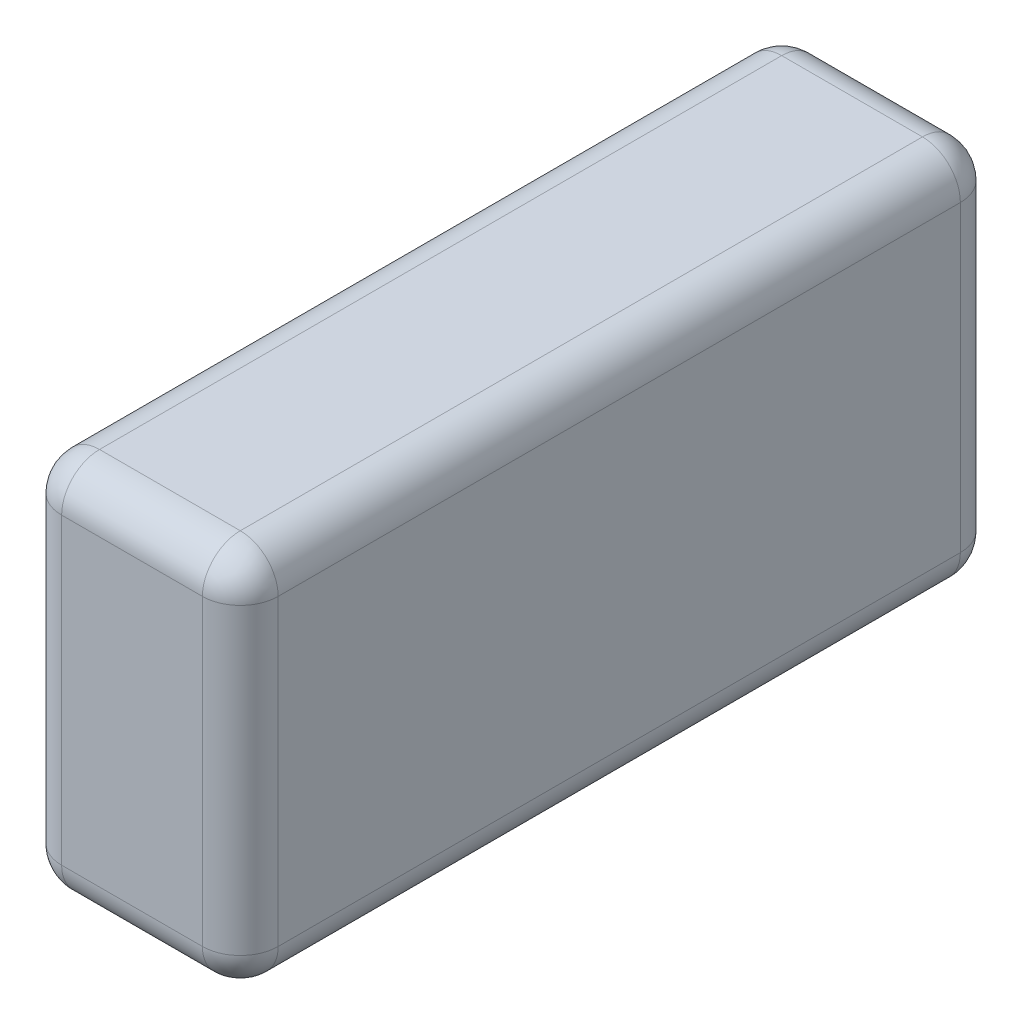
ISO-10303-21;
HEADER;
FILE_DESCRIPTION(('STEP AP214'),'2;1');
FILE_NAME('part.step','',(''),(''),'','','');
FILE_SCHEMA(('AUTOMOTIVE_DESIGN { 1 0 10303 214 1 1 1 1 }'));
ENDSEC;
DATA;
#1=APPLICATION_CONTEXT('core data for automotive mechanical design processes');
#2=APPLICATION_PROTOCOL_DEFINITION('international standard','automotive_design',2000,#1);
#3=PRODUCT_CONTEXT('',#1,'mechanical');
#4=PRODUCT('Part','Part','',(#3));
#5=PRODUCT_RELATED_PRODUCT_CATEGORY('part','',(#4));
#6=PRODUCT_DEFINITION_FORMATION('','',#4);
#7=PRODUCT_DEFINITION_CONTEXT('part definition',#1,'design');
#8=PRODUCT_DEFINITION('design','',#6,#7);
#9=PRODUCT_DEFINITION_SHAPE('','',#8);
#10=(LENGTH_UNIT() NAMED_UNIT(*) SI_UNIT(.MILLI.,.METRE.));
#11=(NAMED_UNIT(*) PLANE_ANGLE_UNIT() SI_UNIT($,.RADIAN.));
#12=(NAMED_UNIT(*) SI_UNIT($,.STERADIAN.) SOLID_ANGLE_UNIT());
#13=UNCERTAINTY_MEASURE_WITH_UNIT(LENGTH_MEASURE(1.E-05),#10,'distance_accuracy_value','');
#14=(GEOMETRIC_REPRESENTATION_CONTEXT(3) GLOBAL_UNCERTAINTY_ASSIGNED_CONTEXT((#13)) GLOBAL_UNIT_ASSIGNED_CONTEXT((#10,
#11,#12)) REPRESENTATION_CONTEXT('',''));
#15=CARTESIAN_POINT('',(0.,0.,0.));
#16=DIRECTION('',(0.,0.,1.));
#17=DIRECTION('',(1.,0.,0.));
#18=AXIS2_PLACEMENT_3D('',#15,#16,#17);
#19=CARTESIAN_POINT('',(200.,205.497925311203,-350.));
#20=DIRECTION('',(0.,0.,1.));
#21=DIRECTION('',(1.,0.,0.));
#22=AXIS2_PLACEMENT_3D('',#19,#20,#21);
#23=PLANE('',#22);
#24=DIRECTION('',(-1.,0.,0.));
#25=VECTOR('',#24,1.);
#26=CARTESIAN_POINT('',(200.,170.497925311203,-350.));
#27=LINE('',#26,#25);
#28=CARTESIAN_POINT('',(35.,170.497925311203,-350.));
#29=VERTEX_POINT('',#28);
#30=CARTESIAN_POINT('',(165.,170.497925311203,-350.));
#31=VERTEX_POINT('',#30);
#32=EDGE_CURVE('E142',#29,#31,#27,.F.);
#33=ORIENTED_EDGE('',*,*,#32,.T.);
#34=DIRECTION('',(0.,1.,0.));
#35=VECTOR('',#34,1.);
#36=CARTESIAN_POINT('',(165.,-144.502074688797,-350.));
#37=LINE('',#36,#35);
#38=CARTESIAN_POINT('',(165.,-109.502074688797,-350.));
#39=VERTEX_POINT('',#38);
#40=EDGE_CURVE('E188',#31,#39,#37,.F.);
#41=ORIENTED_EDGE('',*,*,#40,.T.);
#42=DIRECTION('',(-1.,0.,0.));
#43=VECTOR('',#42,1.);
#44=CARTESIAN_POINT('',(200.,-109.502074688797,-350.));
#45=LINE('',#44,#43);
#46=CARTESIAN_POINT('',(35.,-109.502074688797,-350.));
#47=VERTEX_POINT('',#46);
#48=EDGE_CURVE('E183',#39,#47,#45,.T.);
#49=ORIENTED_EDGE('',*,*,#48,.T.);
#50=DIRECTION('',(0.,1.,0.));
#51=VECTOR('',#50,1.);
#52=CARTESIAN_POINT('',(35.,205.497925311203,-350.));
#53=LINE('',#52,#51);
#54=EDGE_CURVE('E177',#47,#29,#53,.T.);
#55=ORIENTED_EDGE('',*,*,#54,.T.);
#56=EDGE_LOOP('',(#33,#41,#49,#55));
#57=FACE_BOUND('',#56,.T.);
#58=ADVANCED_FACE('F45',(#57),#23,.F.);
#59=CARTESIAN_POINT('',(200.,205.497925311203,350.));
#60=DIRECTION('',(0.,-1.,0.));
#61=DIRECTION('',(0.,0.,-1.));
#62=AXIS2_PLACEMENT_3D('',#59,#60,#61);
#63=PLANE('',#62);
#64=DIRECTION('',(-1.,0.,0.));
#65=VECTOR('',#64,1.);
#66=CARTESIAN_POINT('',(200.,205.497925311203,315.));
#67=LINE('',#66,#65);
#68=CARTESIAN_POINT('',(35.,205.497925311203,315.));
#69=VERTEX_POINT('',#68);
#70=CARTESIAN_POINT('',(165.,205.497925311203,315.));
#71=VERTEX_POINT('',#70);
#72=EDGE_CURVE('E167',#69,#71,#67,.F.);
#73=ORIENTED_EDGE('',*,*,#72,.T.);
#74=DIRECTION('',(0.,0.,1.));
#75=VECTOR('',#74,1.);
#76=CARTESIAN_POINT('',(165.,205.497925311203,-350.));
#77=LINE('',#76,#75);
#78=CARTESIAN_POINT('',(165.,205.497925311203,-315.));
#79=VERTEX_POINT('',#78);
#80=EDGE_CURVE('E171',#71,#79,#77,.F.);
#81=ORIENTED_EDGE('',*,*,#80,.T.);
#82=DIRECTION('',(-1.,0.,0.));
#83=VECTOR('',#82,1.);
#84=CARTESIAN_POINT('',(200.,205.497925311203,-315.));
#85=LINE('',#84,#83);
#86=CARTESIAN_POINT('',(35.,205.497925311203,-315.));
#87=VERTEX_POINT('',#86);
#88=EDGE_CURVE('E140',#79,#87,#85,.T.);
#89=ORIENTED_EDGE('',*,*,#88,.T.);
#90=DIRECTION('',(0.,0.,1.));
#91=VECTOR('',#90,1.);
#92=CARTESIAN_POINT('',(35.,205.497925311203,350.));
#93=LINE('',#92,#91);
#94=EDGE_CURVE('E160',#87,#69,#93,.T.);
#95=ORIENTED_EDGE('',*,*,#94,.T.);
#96=EDGE_LOOP('',(#73,#81,#89,#95));
#97=FACE_BOUND('',#96,.T.);
#98=ADVANCED_FACE('F169',(#97),#63,.F.);
#99=CARTESIAN_POINT('',(200.,205.497925311203,350.));
#100=DIRECTION('',(0.,0.,-1.));
#101=DIRECTION('',(-1.,0.,0.));
#102=AXIS2_PLACEMENT_3D('',#99,#100,#101);
#103=PLANE('',#102);
#104=DIRECTION('',(-1.,0.,0.));
#105=VECTOR('',#104,1.);
#106=CARTESIAN_POINT('',(200.,-109.502074688797,350.));
#107=LINE('',#106,#105);
#108=CARTESIAN_POINT('',(35.,-109.502074688797,350.));
#109=VERTEX_POINT('',#108);
#110=CARTESIAN_POINT('',(165.,-109.502074688797,350.));
#111=VERTEX_POINT('',#110);
#112=EDGE_CURVE('E194',#109,#111,#107,.F.);
#113=ORIENTED_EDGE('',*,*,#112,.T.);
#114=DIRECTION('',(0.,-1.,0.));
#115=VECTOR('',#114,1.);
#116=CARTESIAN_POINT('',(165.,205.497925311203,350.));
#117=LINE('',#116,#115);
#118=CARTESIAN_POINT('',(165.,170.497925311203,350.));
#119=VERTEX_POINT('',#118);
#120=EDGE_CURVE('E201',#111,#119,#117,.F.);
#121=ORIENTED_EDGE('',*,*,#120,.T.);
#122=DIRECTION('',(-1.,0.,0.));
#123=VECTOR('',#122,1.);
#124=CARTESIAN_POINT('',(200.,170.497925311203,350.));
#125=LINE('',#124,#123);
#126=CARTESIAN_POINT('',(35.,170.497925311203,350.));
#127=VERTEX_POINT('',#126);
#128=EDGE_CURVE('E197',#119,#127,#125,.T.);
#129=ORIENTED_EDGE('',*,*,#128,.T.);
#130=DIRECTION('',(0.,-1.,0.));
#131=VECTOR('',#130,1.);
#132=CARTESIAN_POINT('',(35.,205.497925311203,350.));
#133=LINE('',#132,#131);
#134=EDGE_CURVE('E191',#127,#109,#133,.T.);
#135=ORIENTED_EDGE('',*,*,#134,.T.);
#136=EDGE_LOOP('',(#113,#121,#129,#135));
#137=FACE_BOUND('',#136,.T.);
#138=ADVANCED_FACE('F340',(#137),#103,.F.);
#139=CARTESIAN_POINT('',(200.,-144.502074688797,350.));
#140=DIRECTION('',(0.,1.,0.));
#141=DIRECTION('',(0.,0.,1.));
#142=AXIS2_PLACEMENT_3D('',#139,#140,#141);
#143=PLANE('',#142);
#144=DIRECTION('',(-1.,0.,0.));
#145=VECTOR('',#144,1.);
#146=CARTESIAN_POINT('',(200.,-144.502074688797,-315.));
#147=LINE('',#146,#145);
#148=CARTESIAN_POINT('',(35.,-144.502074688797,-315.));
#149=VERTEX_POINT('',#148);
#150=CARTESIAN_POINT('',(165.,-144.502074688797,-315.));
#151=VERTEX_POINT('',#150);
#152=EDGE_CURVE('E207',#149,#151,#147,.F.);
#153=ORIENTED_EDGE('',*,*,#152,.T.);
#154=DIRECTION('',(0.,0.,-1.));
#155=VECTOR('',#154,1.);
#156=CARTESIAN_POINT('',(165.,-144.502074688797,350.));
#157=LINE('',#156,#155);
#158=CARTESIAN_POINT('',(165.,-144.502074688797,315.));
#159=VERTEX_POINT('',#158);
#160=EDGE_CURVE('E214',#151,#159,#157,.F.);
#161=ORIENTED_EDGE('',*,*,#160,.T.);
#162=DIRECTION('',(-1.,0.,0.));
#163=VECTOR('',#162,1.);
#164=CARTESIAN_POINT('',(200.,-144.502074688797,315.));
#165=LINE('',#164,#163);
#166=CARTESIAN_POINT('',(35.,-144.502074688797,315.));
#167=VERTEX_POINT('',#166);
#168=EDGE_CURVE('E210',#159,#167,#165,.T.);
#169=ORIENTED_EDGE('',*,*,#168,.T.);
#170=DIRECTION('',(0.,0.,-1.));
#171=VECTOR('',#170,1.);
#172=CARTESIAN_POINT('',(35.,-144.502074688797,350.));
#173=LINE('',#172,#171);
#174=EDGE_CURVE('E204',#167,#149,#173,.T.);
#175=ORIENTED_EDGE('',*,*,#174,.T.);
#176=EDGE_LOOP('',(#153,#161,#169,#175));
#177=FACE_BOUND('',#176,.T.);
#178=ADVANCED_FACE('F351',(#177),#143,.F.);
#179=CARTESIAN_POINT('',(200.,0.,0.));
#180=DIRECTION('',(1.,0.,0.));
#181=DIRECTION('',(0.,0.,-1.));
#182=AXIS2_PLACEMENT_3D('',#179,#180,#181);
#183=PLANE('',#182);
#184=DIRECTION('',(0.,-1.,0.));
#185=VECTOR('',#184,1.);
#186=CARTESIAN_POINT('',(200.,-144.502074688797,315.));
#187=LINE('',#186,#185);
#188=CARTESIAN_POINT('',(200.,170.497925311203,315.));
#189=VERTEX_POINT('',#188);
#190=CARTESIAN_POINT('',(200.,-109.502074688797,315.));
#191=VERTEX_POINT('',#190);
#192=EDGE_CURVE('E223',#189,#191,#187,.T.);
#193=ORIENTED_EDGE('',*,*,#192,.T.);
#194=DIRECTION('',(0.,0.,-1.));
#195=VECTOR('',#194,1.);
#196=CARTESIAN_POINT('',(200.,-109.502074688797,-350.));
#197=LINE('',#196,#195);
#198=CARTESIAN_POINT('',(200.,-109.502074688797,-315.));
#199=VERTEX_POINT('',#198);
#200=EDGE_CURVE('E226',#191,#199,#197,.T.);
#201=ORIENTED_EDGE('',*,*,#200,.T.);
#202=DIRECTION('',(0.,1.,0.));
#203=VECTOR('',#202,1.);
#204=CARTESIAN_POINT('',(200.,205.497925311203,-315.));
#205=LINE('',#204,#203);
#206=CARTESIAN_POINT('',(200.,170.497925311203,-315.));
#207=VERTEX_POINT('',#206);
#208=EDGE_CURVE('E217',#199,#207,#205,.T.);
#209=ORIENTED_EDGE('',*,*,#208,.T.);
#210=DIRECTION('',(0.,0.,1.));
#211=VECTOR('',#210,1.);
#212=CARTESIAN_POINT('',(200.,170.497925311203,350.));
#213=LINE('',#212,#211);
#214=EDGE_CURVE('E220',#207,#189,#213,.T.);
#215=ORIENTED_EDGE('',*,*,#214,.T.);
#216=EDGE_LOOP('',(#193,#201,#209,#215));
#217=FACE_BOUND('',#216,.T.);
#218=ADVANCED_FACE('F332',(#217),#183,.T.);
#219=CARTESIAN_POINT('',(0.,0.,0.));
#220=DIRECTION('',(1.,0.,0.));
#221=DIRECTION('',(0.,0.,-1.));
#222=AXIS2_PLACEMENT_3D('',#219,#220,#221);
#223=PLANE('',#222);
#224=DIRECTION('',(0.,-1.,0.));
#225=VECTOR('',#224,1.);
#226=CARTESIAN_POINT('',(0.,0.,315.));
#227=LINE('',#226,#225);
#228=CARTESIAN_POINT('',(0.,-109.502074688797,315.));
#229=VERTEX_POINT('',#228);
#230=CARTESIAN_POINT('',(0.,170.497925311203,315.));
#231=VERTEX_POINT('',#230);
#232=EDGE_CURVE('E55',#229,#231,#227,.F.);
#233=ORIENTED_EDGE('',*,*,#232,.T.);
#234=DIRECTION('',(0.,0.,1.));
#235=VECTOR('',#234,1.);
#236=CARTESIAN_POINT('',(0.,170.497925311203,0.));
#237=LINE('',#236,#235);
#238=CARTESIAN_POINT('',(0.,170.497925311203,-315.));
#239=VERTEX_POINT('',#238);
#240=EDGE_CURVE('E11',#231,#239,#237,.F.);
#241=ORIENTED_EDGE('',*,*,#240,.T.);
#242=DIRECTION('',(0.,1.,0.));
#243=VECTOR('',#242,1.);
#244=CARTESIAN_POINT('',(0.,0.,-315.));
#245=LINE('',#244,#243);
#246=CARTESIAN_POINT('',(0.,-109.502074688797,-315.));
#247=VERTEX_POINT('',#246);
#248=EDGE_CURVE('E230',#239,#247,#245,.F.);
#249=ORIENTED_EDGE('',*,*,#248,.T.);
#250=DIRECTION('',(0.,0.,-1.));
#251=VECTOR('',#250,1.);
#252=CARTESIAN_POINT('',(0.,-109.502074688797,0.));
#253=LINE('',#252,#251);
#254=EDGE_CURVE('E66',#247,#229,#253,.F.);
#255=ORIENTED_EDGE('',*,*,#254,.T.);
#256=EDGE_LOOP('',(#233,#241,#249,#255));
#257=FACE_BOUND('',#256,.T.);
#258=ADVANCED_FACE('F577',(#257),#223,.F.);
#259=CARTESIAN_POINT('',(200.,-109.502074688797,315.));
#260=DIRECTION('',(-1.,0.,0.));
#261=DIRECTION('',(0.,0.,1.));
#262=AXIS2_PLACEMENT_3D('',#259,#260,#261);
#263=CYLINDRICAL_SURFACE('',#262,35.);
#264=CARTESIAN_POINT('',(165.,-109.502074688797,315.));
#265=DIRECTION('',(1.,0.,0.));
#266=DIRECTION('',(0.,0.,-1.));
#267=AXIS2_PLACEMENT_3D('',#264,#265,#266);
#268=CIRCLE('',#267,35.);
#269=EDGE_CURVE('E49',#111,#159,#268,.T.);
#270=ORIENTED_EDGE('',*,*,#269,.F.);
#271=ORIENTED_EDGE('',*,*,#112,.F.);
#272=CARTESIAN_POINT('',(35.,-109.502074688797,315.));
#273=DIRECTION('',(-1.,0.,0.));
#274=DIRECTION('',(0.,0.,1.));
#275=AXIS2_PLACEMENT_3D('',#272,#273,#274);
#276=CIRCLE('',#275,35.);
#277=EDGE_CURVE('E307',#167,#109,#276,.T.);
#278=ORIENTED_EDGE('',*,*,#277,.F.);
#279=ORIENTED_EDGE('',*,*,#168,.F.);
#280=EDGE_LOOP('',(#270,#271,#278,#279));
#281=FACE_BOUND('',#280,.T.);
#282=ADVANCED_FACE('F47',(#281),#263,.T.);
#283=CARTESIAN_POINT('',(165.,-109.502074688797,315.));
#284=DIRECTION('',(0.,-1.,0.));
#285=DIRECTION('',(0.,0.,-1.));
#286=AXIS2_PLACEMENT_3D('',#283,#284,#285);
#287=SPHERICAL_SURFACE('',#286,35.);
#288=CARTESIAN_POINT('',(165.,-109.502074688797,315.));
#289=DIRECTION('',(0.,-1.,0.));
#290=DIRECTION('',(0.,0.,-1.));
#291=AXIS2_PLACEMENT_3D('',#288,#289,#290);
#292=CIRCLE('',#291,35.);
#293=EDGE_CURVE('E300',#111,#191,#292,.F.);
#294=ORIENTED_EDGE('',*,*,#293,.F.);
#295=ORIENTED_EDGE('',*,*,#269,.T.);
#296=CARTESIAN_POINT('',(165.,-109.502074688797,315.));
#297=DIRECTION('',(0.,0.,1.));
#298=DIRECTION('',(1.,0.,0.));
#299=AXIS2_PLACEMENT_3D('',#296,#297,#298);
#300=CIRCLE('',#299,35.);
#301=EDGE_CURVE('E304',#191,#159,#300,.F.);
#302=ORIENTED_EDGE('',*,*,#301,.F.);
#303=EDGE_LOOP('',(#294,#295,#302));
#304=FACE_BOUND('',#303,.T.);
#305=ADVANCED_FACE('F320',(#304),#287,.T.);
#306=CARTESIAN_POINT('',(35.,-109.502074688797,315.));
#307=DIRECTION('',(0.,0.,1.));
#308=DIRECTION('',(1.,0.,0.));
#309=AXIS2_PLACEMENT_3D('',#306,#307,#308);
#310=SPHERICAL_SURFACE('',#309,35.);
#311=CARTESIAN_POINT('',(35.,-109.502074688797,315.));
#312=DIRECTION('',(0.,0.,1.));
#313=DIRECTION('',(1.,0.,0.));
#314=AXIS2_PLACEMENT_3D('',#311,#312,#313);
#315=CIRCLE('',#314,35.);
#316=EDGE_CURVE('E293',#167,#229,#315,.F.);
#317=ORIENTED_EDGE('',*,*,#316,.F.);
#318=ORIENTED_EDGE('',*,*,#277,.T.);
#319=CARTESIAN_POINT('',(35.,-109.502074688797,315.));
#320=DIRECTION('',(0.,-1.,0.));
#321=DIRECTION('',(0.,0.,-1.));
#322=AXIS2_PLACEMENT_3D('',#319,#320,#321);
#323=CIRCLE('',#322,35.);
#324=EDGE_CURVE('E296',#229,#109,#323,.F.);
#325=ORIENTED_EDGE('',*,*,#324,.F.);
#326=EDGE_LOOP('',(#317,#318,#325));
#327=FACE_BOUND('',#326,.T.);
#328=ADVANCED_FACE('F550',(#327),#310,.T.);
#329=CARTESIAN_POINT('',(165.,-109.502074688797,0.));
#330=DIRECTION('',(0.,0.,1.));
#331=DIRECTION('',(1.,0.,0.));
#332=AXIS2_PLACEMENT_3D('',#329,#330,#331);
#333=CYLINDRICAL_SURFACE('',#332,35.);
#334=ORIENTED_EDGE('',*,*,#301,.T.);
#335=ORIENTED_EDGE('',*,*,#160,.F.);
#336=CARTESIAN_POINT('',(165.,-109.502074688797,-315.));
#337=DIRECTION('',(0.,0.,-1.));
#338=DIRECTION('',(-1.,0.,0.));
#339=AXIS2_PLACEMENT_3D('',#336,#337,#338);
#340=CIRCLE('',#339,35.);
#341=EDGE_CURVE('E285',#199,#151,#340,.T.);
#342=ORIENTED_EDGE('',*,*,#341,.F.);
#343=ORIENTED_EDGE('',*,*,#200,.F.);
#344=EDGE_LOOP('',(#334,#335,#342,#343));
#345=FACE_BOUND('',#344,.T.);
#346=ADVANCED_FACE('F328',(#345),#333,.T.);
#347=CARTESIAN_POINT('',(165.,0.,315.));
#348=DIRECTION('',(0.,1.,0.));
#349=DIRECTION('',(0.,0.,1.));
#350=AXIS2_PLACEMENT_3D('',#347,#348,#349);
#351=CYLINDRICAL_SURFACE('',#350,35.);
#352=ORIENTED_EDGE('',*,*,#293,.T.);
#353=ORIENTED_EDGE('',*,*,#192,.F.);
#354=CARTESIAN_POINT('',(165.,170.497925311203,315.));
#355=DIRECTION('',(0.,1.,0.));
#356=DIRECTION('',(0.,0.,1.));
#357=AXIS2_PLACEMENT_3D('',#354,#355,#356);
#358=CIRCLE('',#357,35.);
#359=EDGE_CURVE('E281',#119,#189,#358,.T.);
#360=ORIENTED_EDGE('',*,*,#359,.F.);
#361=ORIENTED_EDGE('',*,*,#120,.F.);
#362=EDGE_LOOP('',(#352,#353,#360,#361));
#363=FACE_BOUND('',#362,.T.);
#364=ADVANCED_FACE('F337',(#363),#351,.T.);
#365=CARTESIAN_POINT('',(200.,170.497925311203,315.));
#366=DIRECTION('',(-1.,0.,0.));
#367=DIRECTION('',(0.,0.,1.));
#368=AXIS2_PLACEMENT_3D('',#365,#366,#367);
#369=CYLINDRICAL_SURFACE('',#368,35.);
#370=CARTESIAN_POINT('',(35.,170.497925311203,315.));
#371=DIRECTION('',(-1.,0.,0.));
#372=DIRECTION('',(0.,0.,1.));
#373=AXIS2_PLACEMENT_3D('',#370,#371,#372);
#374=CIRCLE('',#373,35.);
#375=EDGE_CURVE('E273',#127,#69,#374,.T.);
#376=ORIENTED_EDGE('',*,*,#375,.F.);
#377=ORIENTED_EDGE('',*,*,#128,.F.);
#378=CARTESIAN_POINT('',(165.,170.497925311203,315.));
#379=DIRECTION('',(1.,0.,0.));
#380=DIRECTION('',(0.,0.,-1.));
#381=AXIS2_PLACEMENT_3D('',#378,#379,#380);
#382=CIRCLE('',#381,35.);
#383=EDGE_CURVE('E277',#71,#119,#382,.T.);
#384=ORIENTED_EDGE('',*,*,#383,.F.);
#385=ORIENTED_EDGE('',*,*,#72,.F.);
#386=EDGE_LOOP('',(#376,#377,#384,#385));
#387=FACE_BOUND('',#386,.T.);
#388=ADVANCED_FACE('F344',(#387),#369,.T.);
#389=CARTESIAN_POINT('',(35.,205.497925311203,315.));
#390=DIRECTION('',(0.,-1.,0.));
#391=DIRECTION('',(0.,0.,-1.));
#392=AXIS2_PLACEMENT_3D('',#389,#390,#391);
#393=CYLINDRICAL_SURFACE('',#392,35.);
#394=ORIENTED_EDGE('',*,*,#324,.T.);
#395=ORIENTED_EDGE('',*,*,#134,.F.);
#396=CARTESIAN_POINT('',(35.,170.497925311203,315.));
#397=DIRECTION('',(0.,1.,0.));
#398=DIRECTION('',(0.,0.,1.));
#399=AXIS2_PLACEMENT_3D('',#396,#397,#398);
#400=CIRCLE('',#399,35.);
#401=EDGE_CURVE('E270',#231,#127,#400,.T.);
#402=ORIENTED_EDGE('',*,*,#401,.F.);
#403=ORIENTED_EDGE('',*,*,#232,.F.);
#404=EDGE_LOOP('',(#394,#395,#402,#403));
#405=FACE_BOUND('',#404,.T.);
#406=ADVANCED_FACE('F349',(#405),#393,.T.);
#407=CARTESIAN_POINT('',(35.,-109.502074688797,350.));
#408=DIRECTION('',(0.,0.,-1.));
#409=DIRECTION('',(-1.,0.,0.));
#410=AXIS2_PLACEMENT_3D('',#407,#408,#409);
#411=CYLINDRICAL_SURFACE('',#410,35.);
#412=ORIENTED_EDGE('',*,*,#316,.T.);
#413=ORIENTED_EDGE('',*,*,#254,.F.);
#414=CARTESIAN_POINT('',(35.,-109.502074688797,-315.));
#415=DIRECTION('',(0.,0.,-1.));
#416=DIRECTION('',(-1.,0.,0.));
#417=AXIS2_PLACEMENT_3D('',#414,#415,#416);
#418=CIRCLE('',#417,35.);
#419=EDGE_CURVE('E266',#149,#247,#418,.T.);
#420=ORIENTED_EDGE('',*,*,#419,.F.);
#421=ORIENTED_EDGE('',*,*,#174,.F.);
#422=EDGE_LOOP('',(#412,#413,#420,#421));
#423=FACE_BOUND('',#422,.T.);
#424=ADVANCED_FACE('F360',(#423),#411,.T.);
#425=CARTESIAN_POINT('',(200.,-109.502074688797,-315.));
#426=DIRECTION('',(-1.,0.,0.));
#427=DIRECTION('',(0.,0.,1.));
#428=AXIS2_PLACEMENT_3D('',#425,#426,#427);
#429=CYLINDRICAL_SURFACE('',#428,35.);
#430=CARTESIAN_POINT('',(165.,-109.502074688797,-315.));
#431=DIRECTION('',(1.,0.,0.));
#432=DIRECTION('',(0.,0.,-1.));
#433=AXIS2_PLACEMENT_3D('',#430,#431,#432);
#434=CIRCLE('',#433,35.);
#435=EDGE_CURVE('E289',#151,#39,#434,.T.);
#436=ORIENTED_EDGE('',*,*,#435,.F.);
#437=ORIENTED_EDGE('',*,*,#152,.F.);
#438=CARTESIAN_POINT('',(35.,-109.502074688797,-315.));
#439=DIRECTION('',(-1.,0.,0.));
#440=DIRECTION('',(0.,0.,1.));
#441=AXIS2_PLACEMENT_3D('',#438,#439,#440);
#442=CIRCLE('',#441,35.);
#443=EDGE_CURVE('E262',#47,#149,#442,.T.);
#444=ORIENTED_EDGE('',*,*,#443,.F.);
#445=ORIENTED_EDGE('',*,*,#48,.F.);
#446=EDGE_LOOP('',(#436,#437,#444,#445));
#447=FACE_BOUND('',#446,.T.);
#448=ADVANCED_FACE('F356',(#447),#429,.T.);
#449=CARTESIAN_POINT('',(165.,-109.502074688797,-315.));
#450=DIRECTION('',(0.,-1.,0.));
#451=DIRECTION('',(0.,0.,-1.));
#452=AXIS2_PLACEMENT_3D('',#449,#450,#451);
#453=SPHERICAL_SURFACE('',#452,35.);
#454=ORIENTED_EDGE('',*,*,#341,.T.);
#455=ORIENTED_EDGE('',*,*,#435,.T.);
#456=CARTESIAN_POINT('',(165.,-109.502074688797,-315.));
#457=DIRECTION('',(0.,-1.,0.));
#458=DIRECTION('',(1.,0.,0.));
#459=AXIS2_PLACEMENT_3D('',#456,#457,#458);
#460=CIRCLE('',#459,35.);
#461=EDGE_CURVE('E258',#199,#39,#460,.F.);
#462=ORIENTED_EDGE('',*,*,#461,.F.);
#463=EDGE_LOOP('',(#454,#455,#462));
#464=FACE_BOUND('',#463,.T.);
#465=ADVANCED_FACE('F370',(#464),#453,.T.);
#466=CARTESIAN_POINT('',(165.,170.497925311203,315.));
#467=DIRECTION('',(0.,0.,1.));
#468=DIRECTION('',(1.,0.,0.));
#469=AXIS2_PLACEMENT_3D('',#466,#467,#468);
#470=SPHERICAL_SURFACE('',#469,35.);
#471=ORIENTED_EDGE('',*,*,#383,.T.);
#472=ORIENTED_EDGE('',*,*,#359,.T.);
#473=CARTESIAN_POINT('',(165.,170.497925311203,315.));
#474=DIRECTION('',(0.,0.,1.));
#475=DIRECTION('',(1.,0.,0.));
#476=AXIS2_PLACEMENT_3D('',#473,#474,#475);
#477=CIRCLE('',#476,35.);
#478=EDGE_CURVE('E254',#71,#189,#477,.F.);
#479=ORIENTED_EDGE('',*,*,#478,.F.);
#480=EDGE_LOOP('',(#471,#472,#479));
#481=FACE_BOUND('',#480,.T.);
#482=ADVANCED_FACE('F380',(#481),#470,.T.);
#483=CARTESIAN_POINT('',(35.,170.497925311203,315.));
#484=DIRECTION('',(0.,0.,1.));
#485=DIRECTION('',(1.,0.,0.));
#486=AXIS2_PLACEMENT_3D('',#483,#484,#485);
#487=SPHERICAL_SURFACE('',#486,35.);
#488=ORIENTED_EDGE('',*,*,#401,.T.);
#489=ORIENTED_EDGE('',*,*,#375,.T.);
#490=CARTESIAN_POINT('',(35.,170.497925311203,315.));
#491=DIRECTION('',(0.,0.,1.));
#492=DIRECTION('',(1.,0.,0.));
#493=AXIS2_PLACEMENT_3D('',#490,#491,#492);
#494=CIRCLE('',#493,35.);
#495=EDGE_CURVE('E163',#231,#69,#494,.F.);
#496=ORIENTED_EDGE('',*,*,#495,.F.);
#497=EDGE_LOOP('',(#488,#489,#496));
#498=FACE_BOUND('',#497,.T.);
#499=ADVANCED_FACE('F382',(#498),#487,.T.);
#500=CARTESIAN_POINT('',(35.,-109.502074688797,-315.));
#501=DIRECTION('',(0.,-1.,0.));
#502=DIRECTION('',(0.,0.,-1.));
#503=AXIS2_PLACEMENT_3D('',#500,#501,#502);
#504=SPHERICAL_SURFACE('',#503,35.);
#505=ORIENTED_EDGE('',*,*,#443,.T.);
#506=ORIENTED_EDGE('',*,*,#419,.T.);
#507=CARTESIAN_POINT('',(35.,-109.502074688797,-315.));
#508=DIRECTION('',(0.,-1.,0.));
#509=DIRECTION('',(0.,0.,-1.));
#510=AXIS2_PLACEMENT_3D('',#507,#508,#509);
#511=CIRCLE('',#510,35.);
#512=EDGE_CURVE('E248',#47,#247,#511,.F.);
#513=ORIENTED_EDGE('',*,*,#512,.F.);
#514=EDGE_LOOP('',(#505,#506,#513));
#515=FACE_BOUND('',#514,.T.);
#516=ADVANCED_FACE('F362',(#515),#504,.T.);
#517=CARTESIAN_POINT('',(165.,0.,-315.));
#518=DIRECTION('',(0.,-1.,0.));
#519=DIRECTION('',(0.,0.,-1.));
#520=AXIS2_PLACEMENT_3D('',#517,#518,#519);
#521=CYLINDRICAL_SURFACE('',#520,35.);
#522=ORIENTED_EDGE('',*,*,#461,.T.);
#523=ORIENTED_EDGE('',*,*,#40,.F.);
#524=CARTESIAN_POINT('',(165.,170.497925311203,-315.));
#525=DIRECTION('',(0.,1.,0.));
#526=DIRECTION('',(0.,0.,1.));
#527=AXIS2_PLACEMENT_3D('',#524,#525,#526);
#528=CIRCLE('',#527,35.);
#529=EDGE_CURVE('E244',#207,#31,#528,.T.);
#530=ORIENTED_EDGE('',*,*,#529,.F.);
#531=ORIENTED_EDGE('',*,*,#208,.F.);
#532=EDGE_LOOP('',(#522,#523,#530,#531));
#533=FACE_BOUND('',#532,.T.);
#534=ADVANCED_FACE('F372',(#533),#521,.T.);
#535=CARTESIAN_POINT('',(165.,170.497925311203,0.));
#536=DIRECTION('',(0.,0.,-1.));
#537=DIRECTION('',(-1.,0.,0.));
#538=AXIS2_PLACEMENT_3D('',#535,#536,#537);
#539=CYLINDRICAL_SURFACE('',#538,35.);
#540=ORIENTED_EDGE('',*,*,#478,.T.);
#541=ORIENTED_EDGE('',*,*,#214,.F.);
#542=CARTESIAN_POINT('',(165.,170.497925311203,-315.));
#543=DIRECTION('',(0.,0.,-1.));
#544=DIRECTION('',(-1.,0.,0.));
#545=AXIS2_PLACEMENT_3D('',#542,#543,#544);
#546=CIRCLE('',#545,35.);
#547=EDGE_CURVE('E157',#79,#207,#546,.T.);
#548=ORIENTED_EDGE('',*,*,#547,.F.);
#549=ORIENTED_EDGE('',*,*,#80,.F.);
#550=EDGE_LOOP('',(#540,#541,#548,#549));
#551=FACE_BOUND('',#550,.T.);
#552=ADVANCED_FACE('F378',(#551),#539,.T.);
#553=CARTESIAN_POINT('',(35.,170.497925311203,350.));
#554=DIRECTION('',(0.,0.,1.));
#555=DIRECTION('',(1.,0.,0.));
#556=AXIS2_PLACEMENT_3D('',#553,#554,#555);
#557=CYLINDRICAL_SURFACE('',#556,35.);
#558=ORIENTED_EDGE('',*,*,#495,.T.);
#559=ORIENTED_EDGE('',*,*,#94,.F.);
#560=CARTESIAN_POINT('',(35.,170.497925311203,-315.));
#561=DIRECTION('',(0.,0.,-1.));
#562=DIRECTION('',(-1.,0.,0.));
#563=AXIS2_PLACEMENT_3D('',#560,#561,#562);
#564=CIRCLE('',#563,35.);
#565=EDGE_CURVE('E148',#239,#87,#564,.T.);
#566=ORIENTED_EDGE('',*,*,#565,.F.);
#567=ORIENTED_EDGE('',*,*,#240,.F.);
#568=EDGE_LOOP('',(#558,#559,#566,#567));
#569=FACE_BOUND('',#568,.T.);
#570=ADVANCED_FACE('F161',(#569),#557,.T.);
#571=CARTESIAN_POINT('',(35.,205.497925311203,-315.));
#572=DIRECTION('',(0.,1.,0.));
#573=DIRECTION('',(0.,0.,1.));
#574=AXIS2_PLACEMENT_3D('',#571,#572,#573);
#575=CYLINDRICAL_SURFACE('',#574,35.);
#576=ORIENTED_EDGE('',*,*,#512,.T.);
#577=ORIENTED_EDGE('',*,*,#248,.F.);
#578=CARTESIAN_POINT('',(35.,170.497925311203,-315.));
#579=DIRECTION('',(0.,1.,0.));
#580=DIRECTION('',(0.,0.,1.));
#581=AXIS2_PLACEMENT_3D('',#578,#579,#580);
#582=CIRCLE('',#581,35.);
#583=EDGE_CURVE('E152',#29,#239,#582,.T.);
#584=ORIENTED_EDGE('',*,*,#583,.F.);
#585=ORIENTED_EDGE('',*,*,#54,.F.);
#586=EDGE_LOOP('',(#576,#577,#584,#585));
#587=FACE_BOUND('',#586,.T.);
#588=ADVANCED_FACE('F365',(#587),#575,.T.);
#589=CARTESIAN_POINT('',(165.,170.497925311203,-315.));
#590=DIRECTION('',(1.,0.,0.));
#591=DIRECTION('',(0.,0.,-1.));
#592=AXIS2_PLACEMENT_3D('',#589,#590,#591);
#593=SPHERICAL_SURFACE('',#592,35.);
#594=ORIENTED_EDGE('',*,*,#547,.T.);
#595=ORIENTED_EDGE('',*,*,#529,.T.);
#596=CARTESIAN_POINT('',(165.,170.497925311203,-315.));
#597=DIRECTION('',(1.,0.,0.));
#598=DIRECTION('',(0.,0.,-1.));
#599=AXIS2_PLACEMENT_3D('',#596,#597,#598);
#600=CIRCLE('',#599,35.);
#601=EDGE_CURVE('E145',#79,#31,#600,.F.);
#602=ORIENTED_EDGE('',*,*,#601,.F.);
#603=EDGE_LOOP('',(#594,#595,#602));
#604=FACE_BOUND('',#603,.T.);
#605=ADVANCED_FACE('F376',(#604),#593,.T.);
#606=CARTESIAN_POINT('',(35.,170.497925311203,-315.));
#607=DIRECTION('',(-1.,0.,0.));
#608=DIRECTION('',(0.,0.,1.));
#609=AXIS2_PLACEMENT_3D('',#606,#607,#608);
#610=SPHERICAL_SURFACE('',#609,35.);
#611=ORIENTED_EDGE('',*,*,#583,.T.);
#612=ORIENTED_EDGE('',*,*,#565,.T.);
#613=CARTESIAN_POINT('',(35.,170.497925311203,-315.));
#614=DIRECTION('',(-1.,0.,0.));
#615=DIRECTION('',(0.,0.,1.));
#616=AXIS2_PLACEMENT_3D('',#613,#614,#615);
#617=CIRCLE('',#616,35.);
#618=EDGE_CURVE('E136',#29,#87,#617,.F.);
#619=ORIENTED_EDGE('',*,*,#618,.F.);
#620=EDGE_LOOP('',(#611,#612,#619));
#621=FACE_BOUND('',#620,.T.);
#622=ADVANCED_FACE('F150',(#621),#610,.T.);
#623=CARTESIAN_POINT('',(200.,170.497925311203,-315.));
#624=DIRECTION('',(-1.,0.,0.));
#625=DIRECTION('',(0.,0.,1.));
#626=AXIS2_PLACEMENT_3D('',#623,#624,#625);
#627=CYLINDRICAL_SURFACE('',#626,35.);
#628=ORIENTED_EDGE('',*,*,#601,.T.);
#629=ORIENTED_EDGE('',*,*,#32,.F.);
#630=ORIENTED_EDGE('',*,*,#618,.T.);
#631=ORIENTED_EDGE('',*,*,#88,.F.);
#632=EDGE_LOOP('',(#628,#629,#630,#631));
#633=FACE_BOUND('',#632,.T.);
#634=ADVANCED_FACE('F138',(#633),#627,.T.);
#635=CLOSED_SHELL('',(#58,#98,#138,#178,#218,#258,#282,#305,#328,#346,#364,#388,#406,#424,#448,
#465,#482,#499,#516,#534,#552,#570,#588,#605,#622,#634));
#636=MANIFOLD_SOLID_BREP('B2',#635);
#637=ADVANCED_BREP_SHAPE_REPRESENTATION('',(#18,#636),#14);
#638=SHAPE_DEFINITION_REPRESENTATION(#9,#637);
ENDSEC;
END-ISO-10303-21;
